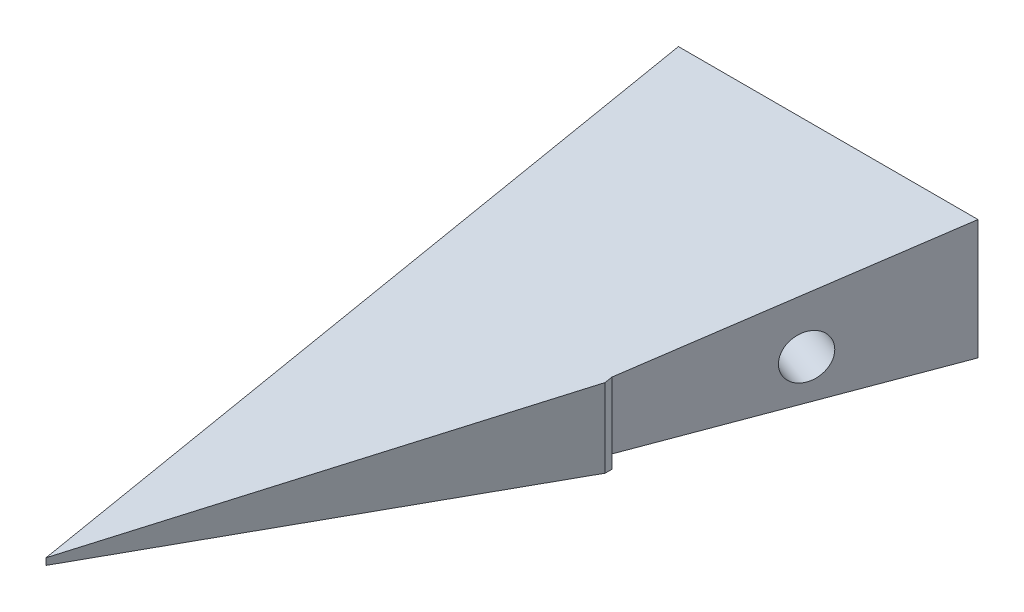
ISO-10303-21;
HEADER;
FILE_DESCRIPTION(('STEP AP214'),'2;1');
FILE_NAME('part.step','',(''),(''),'','','');
FILE_SCHEMA(('AUTOMOTIVE_DESIGN { 1 0 10303 214 1 1 1 1 }'));
ENDSEC;
DATA;
#1=APPLICATION_CONTEXT('core data for automotive mechanical design processes');
#2=APPLICATION_PROTOCOL_DEFINITION('international standard','automotive_design',2000,#1);
#3=PRODUCT_CONTEXT('',#1,'mechanical');
#4=PRODUCT('Part','Part','',(#3));
#5=PRODUCT_RELATED_PRODUCT_CATEGORY('part','',(#4));
#6=PRODUCT_DEFINITION_FORMATION('','',#4);
#7=PRODUCT_DEFINITION_CONTEXT('part definition',#1,'design');
#8=PRODUCT_DEFINITION('design','',#6,#7);
#9=PRODUCT_DEFINITION_SHAPE('','',#8);
#10=(LENGTH_UNIT() NAMED_UNIT(*) SI_UNIT(.MILLI.,.METRE.));
#11=(NAMED_UNIT(*) PLANE_ANGLE_UNIT() SI_UNIT($,.RADIAN.));
#12=(NAMED_UNIT(*) SI_UNIT($,.STERADIAN.) SOLID_ANGLE_UNIT());
#13=UNCERTAINTY_MEASURE_WITH_UNIT(LENGTH_MEASURE(1.E-05),#10,'distance_accuracy_value','');
#14=(GEOMETRIC_REPRESENTATION_CONTEXT(3) GLOBAL_UNCERTAINTY_ASSIGNED_CONTEXT((#13)) GLOBAL_UNIT_ASSIGNED_CONTEXT((#10,
#11,#12)) REPRESENTATION_CONTEXT('',''));
#15=CARTESIAN_POINT('',(0.,0.,0.));
#16=DIRECTION('',(0.,0.,1.));
#17=DIRECTION('',(1.,0.,0.));
#18=AXIS2_PLACEMENT_3D('',#15,#16,#17);
#19=CARTESIAN_POINT('',(-65.,10.,95.));
#20=DIRECTION('',(1.,0.,0.));
#21=DIRECTION('',(0.,0.,-1.));
#22=AXIS2_PLACEMENT_3D('',#19,#20,#21);
#23=PLANE('',#22);
#24=CARTESIAN_POINT('',(-65.,-2.,20.));
#25=DIRECTION('',(-1.,0.,0.));
#26=DIRECTION('',(0.,0.,1.));
#27=AXIS2_PLACEMENT_3D('',#24,#25,#26);
#28=CIRCLE('',#27,3.28999849999999);
#29=CARTESIAN_POINT('',(-65.,-2.,23.2899985));
#30=VERTEX_POINT('',#29);
#31=EDGE_CURVE('E147',#30,#30,#28,.T.);
#32=ORIENTED_EDGE('',*,*,#31,.F.);
#33=EDGE_LOOP('',(#32));
#34=FACE_BOUND('',#33,.T.);
#35=DIRECTION('',(0.,-1.,0.));
#36=VECTOR('',#35,1.);
#37=CARTESIAN_POINT('',(-65.,10.,0.));
#38=LINE('',#37,#36);
#39=CARTESIAN_POINT('',(-65.,10.,0.));
#40=VERTEX_POINT('',#39);
#41=CARTESIAN_POINT('',(-65.,-8.,0.));
#42=VERTEX_POINT('',#41);
#43=EDGE_CURVE('E121',#40,#42,#38,.T.);
#44=ORIENTED_EDGE('',*,*,#43,.T.);
#45=DIRECTION('',(0.,0.,-1.));
#46=VECTOR('',#45,1.);
#47=CARTESIAN_POINT('',(-65.,-8.,40.));
#48=LINE('',#47,#46);
#49=CARTESIAN_POINT('',(-65.,-8.,40.));
#50=VERTEX_POINT('',#49);
#51=EDGE_CURVE('E49',#50,#42,#48,.T.);
#52=ORIENTED_EDGE('',*,*,#51,.F.);
#53=DIRECTION('',(0.,1.,0.));
#54=VECTOR('',#53,1.);
#55=CARTESIAN_POINT('',(-65.,-8.,40.));
#56=LINE('',#55,#54);
#57=CARTESIAN_POINT('',(-65.,-10.,40.));
#58=VERTEX_POINT('',#57);
#59=EDGE_CURVE('E102',#58,#50,#56,.T.);
#60=ORIENTED_EDGE('',*,*,#59,.F.);
#61=DIRECTION('',(0.,0.,-1.));
#62=VECTOR('',#61,1.);
#63=CARTESIAN_POINT('',(-65.,-10.,95.));
#64=LINE('',#63,#62);
#65=CARTESIAN_POINT('',(-65.,-10.,95.));
#66=VERTEX_POINT('',#65);
#67=EDGE_CURVE('E42',#66,#58,#64,.T.);
#68=ORIENTED_EDGE('',*,*,#67,.F.);
#69=DIRECTION('',(0.,-1.,0.));
#70=VECTOR('',#69,1.);
#71=CARTESIAN_POINT('',(-65.,10.,95.));
#72=LINE('',#71,#70);
#73=CARTESIAN_POINT('',(-65.,-9.00000000000001,95.));
#74=VERTEX_POINT('',#73);
#75=EDGE_CURVE('E120',#74,#66,#72,.T.);
#76=ORIENTED_EDGE('',*,*,#75,.F.);
#77=DIRECTION('',(0.,-0.196116135138184,0.98058067569092));
#78=VECTOR('',#77,1.);
#79=CARTESIAN_POINT('',(-65.,-8.26923076923077,91.3461538461538));
#80=LINE('',#79,#78);
#81=EDGE_CURVE('E138',#40,#74,#80,.T.);
#82=ORIENTED_EDGE('',*,*,#81,.F.);
#83=EDGE_LOOP('',(#44,#52,#60,#68,#76,#82));
#84=FACE_BOUND('',#83,.T.);
#85=ADVANCED_FACE('F35',(#34,#84),#23,.F.);
#86=CARTESIAN_POINT('',(-35.,-10.001,40.));
#87=DIRECTION('',(-1.,0.,0.));
#88=DIRECTION('',(0.,0.,1.));
#89=AXIS2_PLACEMENT_3D('',#86,#87,#88);
#90=PLANE('',#89);
#91=DIRECTION('',(0.,0.196116135138184,-0.98058067569092));
#92=VECTOR('',#91,1.);
#93=CARTESIAN_POINT('',(-35.,1.53842307692307,42.3078846153846));
#94=LINE('',#93,#92);
#95=CARTESIAN_POINT('',(-35.,1.8,41.));
#96=VERTEX_POINT('',#95);
#97=CARTESIAN_POINT('',(-35.,2.,40.));
#98=VERTEX_POINT('',#97);
#99=EDGE_CURVE('E141',#96,#98,#94,.T.);
#100=ORIENTED_EDGE('',*,*,#99,.F.);
#101=DIRECTION('',(0.,1.,0.));
#102=VECTOR('',#101,1.);
#103=CARTESIAN_POINT('',(-35.,-10.001,41.));
#104=LINE('',#103,#102);
#105=CARTESIAN_POINT('',(-35.,-10.,41.));
#106=VERTEX_POINT('',#105);
#107=EDGE_CURVE('E129',#106,#96,#104,.T.);
#108=ORIENTED_EDGE('',*,*,#107,.F.);
#109=DIRECTION('',(0.,0.,-1.));
#110=VECTOR('',#109,1.);
#111=CARTESIAN_POINT('',(-35.,-10.,40.));
#112=LINE('',#111,#110);
#113=CARTESIAN_POINT('',(-35.,-10.,40.));
#114=VERTEX_POINT('',#113);
#115=EDGE_CURVE('E132',#106,#114,#112,.T.);
#116=ORIENTED_EDGE('',*,*,#115,.T.);
#117=DIRECTION('',(0.,1.,0.));
#118=VECTOR('',#117,1.);
#119=CARTESIAN_POINT('',(-35.,-10.001,40.));
#120=LINE('',#119,#118);
#121=CARTESIAN_POINT('',(-35.,-8.,40.));
#122=VERTEX_POINT('',#121);
#123=EDGE_CURVE('E103',#114,#122,#120,.T.);
#124=ORIENTED_EDGE('',*,*,#123,.T.);
#125=EDGE_CURVE('E57',#122,#98,#120,.T.);
#126=ORIENTED_EDGE('',*,*,#125,.T.);
#127=EDGE_LOOP('',(#100,#108,#116,#124,#126));
#128=FACE_BOUND('',#127,.T.);
#129=ADVANCED_FACE('F166',(#128),#90,.F.);
#130=CARTESIAN_POINT('',(-35.,-10.001,40.));
#131=DIRECTION('',(0.936329177569045,0.,0.351123441588392));
#132=DIRECTION('',(0.351123441588392,0.,-0.936329177569045));
#133=AXIS2_PLACEMENT_3D('',#130,#131,#132);
#134=PLANE('',#133);
#135=DIRECTION('',(-0.351123441588392,0.,0.936329177569045));
#136=VECTOR('',#135,1.);
#137=CARTESIAN_POINT('',(-35.,-8.,40.));
#138=LINE('',#137,#136);
#139=CARTESIAN_POINT('',(-20.,-8.,0.));
#140=VERTEX_POINT('',#139);
#141=EDGE_CURVE('E156',#140,#122,#138,.T.);
#142=ORIENTED_EDGE('',*,*,#141,.F.);
#143=DIRECTION('',(0.,1.,0.));
#144=VECTOR('',#143,1.);
#145=CARTESIAN_POINT('',(-20.,-10.001,0.));
#146=LINE('',#145,#144);
#147=CARTESIAN_POINT('',(-20.,10.,0.));
#148=VERTEX_POINT('',#147);
#149=EDGE_CURVE('E131',#140,#148,#146,.T.);
#150=ORIENTED_EDGE('',*,*,#149,.T.);
#151=DIRECTION('',(-0.345124094421928,-0.184066183691695,0.920330918458474));
#152=VECTOR('',#151,1.);
#153=CARTESIAN_POINT('',(-35.7623716251985,1.59340179989412,42.0329910005294));
#154=LINE('',#153,#152);
#155=EDGE_CURVE('E136',#148,#98,#154,.T.);
#156=ORIENTED_EDGE('',*,*,#155,.T.);
#157=ORIENTED_EDGE('',*,*,#125,.F.);
#158=EDGE_LOOP('',(#142,#150,#156,#157));
#159=FACE_BOUND('',#158,.T.);
#160=CARTESIAN_POINT('',(-27.0224688317678,-2.,18.7265835513809));
#161=DIRECTION('',(0.936329177569045,0.,0.351123441588392));
#162=DIRECTION('',(0.351123441588392,0.,-0.936329177569045));
#163=AXIS2_PLACEMENT_3D('',#160,#161,#162);
#164=CIRCLE('',#163,3.28999849999999);
#165=CARTESIAN_POINT('',(-25.8672732356272,-2.,15.6460619616725));
#166=VERTEX_POINT('',#165);
#167=EDGE_CURVE('E153',#166,#166,#164,.T.);
#168=ORIENTED_EDGE('',*,*,#167,.F.);
#169=EDGE_LOOP('',(#168));
#170=FACE_BOUND('',#169,.T.);
#171=ADVANCED_FACE('F162',(#159,#170),#134,.T.);
#172=CARTESIAN_POINT('',(-35.,-10.001,41.));
#173=DIRECTION('',(-0.874157276121538,0.,-0.485642931178632));
#174=DIRECTION('',(-0.485642931178632,0.,0.874157276121538));
#175=AXIS2_PLACEMENT_3D('',#172,#173,#174);
#176=PLANE('',#175);
#177=DIRECTION('',(0.478386767867225,0.172219236432201,-0.861096182161005));
#178=VECTOR('',#177,1.);
#179=CARTESIAN_POINT('',(-35.972253753204,1.44998864884658,42.7500567557671));
#180=LINE('',#179,#178);
#181=EDGE_CURVE('E11',#74,#96,#180,.T.);
#182=ORIENTED_EDGE('',*,*,#181,.F.);
#183=ORIENTED_EDGE('',*,*,#75,.T.);
#184=DIRECTION('',(0.485642931178632,0.,-0.874157276121538));
#185=VECTOR('',#184,1.);
#186=CARTESIAN_POINT('',(-35.,-10.,41.));
#187=LINE('',#186,#185);
#188=EDGE_CURVE('E119',#66,#106,#187,.T.);
#189=ORIENTED_EDGE('',*,*,#188,.T.);
#190=ORIENTED_EDGE('',*,*,#107,.T.);
#191=EDGE_LOOP('',(#182,#183,#189,#190));
#192=FACE_BOUND('',#191,.T.);
#193=ADVANCED_FACE('F168',(#192),#176,.F.);
#194=CARTESIAN_POINT('',(-65.,-10.,95.));
#195=DIRECTION('',(0.,1.,0.));
#196=DIRECTION('',(0.,0.,1.));
#197=AXIS2_PLACEMENT_3D('',#194,#195,#196);
#198=PLANE('',#197);
#199=ORIENTED_EDGE('',*,*,#67,.T.);
#200=DIRECTION('',(-1.,0.,0.));
#201=VECTOR('',#200,1.);
#202=CARTESIAN_POINT('',(-65.,-10.,40.));
#203=LINE('',#202,#201);
#204=EDGE_CURVE('E98',#114,#58,#203,.T.);
#205=ORIENTED_EDGE('',*,*,#204,.F.);
#206=ORIENTED_EDGE('',*,*,#115,.F.);
#207=ORIENTED_EDGE('',*,*,#188,.F.);
#208=EDGE_LOOP('',(#199,#205,#206,#207));
#209=FACE_BOUND('',#208,.T.);
#210=ADVANCED_FACE('F117',(#209),#198,.F.);
#211=CARTESIAN_POINT('',(0.,0.,0.));
#212=DIRECTION('',(0.,0.,1.));
#213=DIRECTION('',(1.,0.,0.));
#214=AXIS2_PLACEMENT_3D('',#211,#212,#213);
#215=PLANE('',#214);
#216=ORIENTED_EDGE('',*,*,#149,.F.);
#217=DIRECTION('',(1.,0.,0.));
#218=VECTOR('',#217,1.);
#219=CARTESIAN_POINT('',(-20.,-8.,0.));
#220=LINE('',#219,#218);
#221=EDGE_CURVE('E108',#42,#140,#220,.T.);
#222=ORIENTED_EDGE('',*,*,#221,.F.);
#223=ORIENTED_EDGE('',*,*,#43,.F.);
#224=DIRECTION('',(-1.,0.,0.));
#225=VECTOR('',#224,1.);
#226=CARTESIAN_POINT('',(-65.,10.,0.));
#227=LINE('',#226,#225);
#228=EDGE_CURVE('E125',#148,#40,#227,.T.);
#229=ORIENTED_EDGE('',*,*,#228,.F.);
#230=EDGE_LOOP('',(#216,#222,#223,#229));
#231=FACE_BOUND('',#230,.T.);
#232=ADVANCED_FACE('F174',(#231),#215,.F.);
#233=CARTESIAN_POINT('',(-255.005840993954,10.,0.));
#234=DIRECTION('',(0.,0.98058067569092,0.196116135138184));
#235=DIRECTION('',(0.,-0.196116135138184,0.98058067569092));
#236=AXIS2_PLACEMENT_3D('',#233,#234,#235);
#237=PLANE('',#236);
#238=ORIENTED_EDGE('',*,*,#155,.F.);
#239=ORIENTED_EDGE('',*,*,#228,.T.);
#240=ORIENTED_EDGE('',*,*,#81,.T.);
#241=ORIENTED_EDGE('',*,*,#181,.T.);
#242=ORIENTED_EDGE('',*,*,#99,.T.);
#243=EDGE_LOOP('',(#238,#239,#240,#241,#242));
#244=FACE_BOUND('',#243,.T.);
#245=ADVANCED_FACE('F171',(#244),#237,.T.);
#246=CARTESIAN_POINT('',(-55.,-2.,20.));
#247=DIRECTION('',(-1.,0.,0.));
#248=DIRECTION('',(0.,0.,1.));
#249=AXIS2_PLACEMENT_3D('',#246,#247,#248);
#250=CONICAL_SURFACE('',#249,3.28999849999999,1.02974425867665);
#251=CARTESIAN_POINT('',(-53.0231694646903,-2.,20.));
#252=VERTEX_POINT('',#251);
#253=VERTEX_LOOP('',#252);
#254=FACE_BOUND('',#253,.T.);
#255=CARTESIAN_POINT('',(-55.,-2.,20.));
#256=DIRECTION('',(-1.,0.,0.));
#257=DIRECTION('',(0.,0.,1.));
#258=AXIS2_PLACEMENT_3D('',#255,#256,#257);
#259=CIRCLE('',#258,3.28999849999999);
#260=CARTESIAN_POINT('',(-55.,-2.,23.2899985));
#261=VERTEX_POINT('',#260);
#262=EDGE_CURVE('E144',#261,#261,#259,.T.);
#263=ORIENTED_EDGE('',*,*,#262,.T.);
#264=EDGE_LOOP('',(#263));
#265=FACE_BOUND('',#264,.T.);
#266=ADVANCED_FACE('F197',(#254,#265),#250,.F.);
#267=CARTESIAN_POINT('',(-65.,-2.,20.));
#268=DIRECTION('',(-1.,0.,0.));
#269=DIRECTION('',(0.,0.,1.));
#270=AXIS2_PLACEMENT_3D('',#267,#268,#269);
#271=CYLINDRICAL_SURFACE('',#270,3.28999849999999);
#272=ORIENTED_EDGE('',*,*,#262,.F.);
#273=EDGE_LOOP('',(#272));
#274=FACE_BOUND('',#273,.T.);
#275=ORIENTED_EDGE('',*,*,#31,.T.);
#276=EDGE_LOOP('',(#275));
#277=FACE_BOUND('',#276,.T.);
#278=ADVANCED_FACE('F195',(#274,#277),#271,.F.);
#279=CARTESIAN_POINT('',(-36.3857606074583,-2.,15.215349135497));
#280=DIRECTION('',(0.936329177569045,0.,0.351123441588392));
#281=DIRECTION('',(0.351123441588392,0.,-0.936329177569045));
#282=AXIS2_PLACEMENT_3D('',#279,#280,#281);
#283=CONICAL_SURFACE('',#282,3.28999849999999,1.02974425867665);
#284=CARTESIAN_POINT('',(-38.2367247167782,-2.,14.521237594502));
#285=VERTEX_POINT('',#284);
#286=VERTEX_LOOP('',#285);
#287=FACE_BOUND('',#286,.T.);
#288=CARTESIAN_POINT('',(-36.3857606074583,-2.,15.215349135497));
#289=DIRECTION('',(0.936329177569045,0.,0.351123441588392));
#290=DIRECTION('',(0.351123441588392,0.,-0.936329177569045));
#291=AXIS2_PLACEMENT_3D('',#288,#289,#290);
#292=CIRCLE('',#291,3.28999849999999);
#293=CARTESIAN_POINT('',(-35.2305650113176,-2.,12.1348275457886));
#294=VERTEX_POINT('',#293);
#295=EDGE_CURVE('E150',#294,#294,#292,.T.);
#296=ORIENTED_EDGE('',*,*,#295,.T.);
#297=EDGE_LOOP('',(#296));
#298=FACE_BOUND('',#297,.T.);
#299=ADVANCED_FACE('F184',(#287,#298),#283,.F.);
#300=CARTESIAN_POINT('',(-27.0224688317678,-2.,18.7265835513809));
#301=DIRECTION('',(0.936329177569045,0.,0.351123441588392));
#302=DIRECTION('',(0.351123441588392,0.,-0.936329177569045));
#303=AXIS2_PLACEMENT_3D('',#300,#301,#302);
#304=CYLINDRICAL_SURFACE('',#303,3.28999849999999);
#305=ORIENTED_EDGE('',*,*,#295,.F.);
#306=EDGE_LOOP('',(#305));
#307=FACE_BOUND('',#306,.T.);
#308=ORIENTED_EDGE('',*,*,#167,.T.);
#309=EDGE_LOOP('',(#308));
#310=FACE_BOUND('',#309,.T.);
#311=ADVANCED_FACE('F177',(#307,#310),#304,.F.);
#312=CARTESIAN_POINT('',(-20.,-8.,40.));
#313=DIRECTION('',(0.,1.,0.));
#314=DIRECTION('',(-1.,0.,0.));
#315=AXIS2_PLACEMENT_3D('',#312,#313,#314);
#316=PLANE('',#315);
#317=ORIENTED_EDGE('',*,*,#141,.T.);
#318=DIRECTION('',(1.,0.,0.));
#319=VECTOR('',#318,1.);
#320=CARTESIAN_POINT('',(-20.,-8.,40.));
#321=LINE('',#320,#319);
#322=EDGE_CURVE('E114',#50,#122,#321,.T.);
#323=ORIENTED_EDGE('',*,*,#322,.F.);
#324=ORIENTED_EDGE('',*,*,#51,.T.);
#325=ORIENTED_EDGE('',*,*,#221,.T.);
#326=EDGE_LOOP('',(#317,#323,#324,#325));
#327=FACE_BOUND('',#326,.T.);
#328=ADVANCED_FACE('F175',(#327),#316,.F.);
#329=CARTESIAN_POINT('',(0.,0.,40.));
#330=DIRECTION('',(0.,0.,1.));
#331=DIRECTION('',(1.,0.,0.));
#332=AXIS2_PLACEMENT_3D('',#329,#330,#331);
#333=PLANE('',#332);
#334=ORIENTED_EDGE('',*,*,#123,.F.);
#335=ORIENTED_EDGE('',*,*,#204,.T.);
#336=ORIENTED_EDGE('',*,*,#59,.T.);
#337=ORIENTED_EDGE('',*,*,#322,.T.);
#338=EDGE_LOOP('',(#334,#335,#336,#337));
#339=FACE_BOUND('',#338,.T.);
#340=ADVANCED_FACE('F100',(#339),#333,.F.);
#341=CLOSED_SHELL('',(#85,#129,#171,#193,#210,#232,#245,#266,#278,#299,#311,#328,#340));
#342=MANIFOLD_SOLID_BREP('B2',#341);
#343=ADVANCED_BREP_SHAPE_REPRESENTATION('',(#18,#342),#14);
#344=SHAPE_DEFINITION_REPRESENTATION(#9,#343);
ENDSEC;
END-ISO-10303-21;
